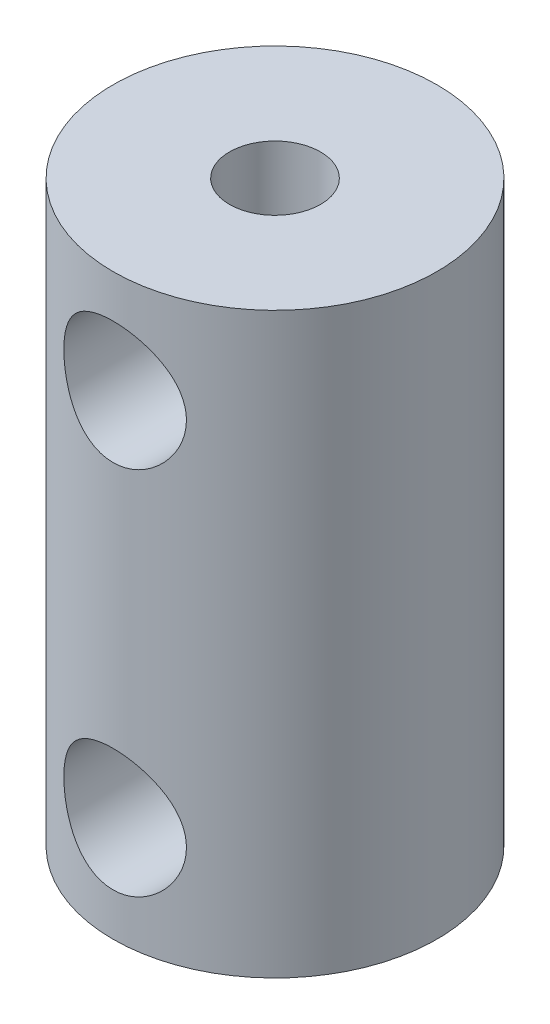
ISO-10303-21;
HEADER;
FILE_DESCRIPTION(('STEP AP214'),'2;1');
FILE_NAME('part.step','',(''),(''),'','','');
FILE_SCHEMA(('AUTOMOTIVE_DESIGN { 1 0 10303 214 1 1 1 1 }'));
ENDSEC;
DATA;
#1=APPLICATION_CONTEXT('core data for automotive mechanical design processes');
#2=APPLICATION_PROTOCOL_DEFINITION('international standard','automotive_design',2000,#1);
#3=PRODUCT_CONTEXT('',#1,'mechanical');
#4=PRODUCT('Part','Part','',(#3));
#5=PRODUCT_RELATED_PRODUCT_CATEGORY('part','',(#4));
#6=PRODUCT_DEFINITION_FORMATION('','',#4);
#7=PRODUCT_DEFINITION_CONTEXT('part definition',#1,'design');
#8=PRODUCT_DEFINITION('design','',#6,#7);
#9=PRODUCT_DEFINITION_SHAPE('','',#8);
#10=(LENGTH_UNIT() NAMED_UNIT(*) SI_UNIT(.MILLI.,.METRE.));
#11=(NAMED_UNIT(*) PLANE_ANGLE_UNIT() SI_UNIT($,.RADIAN.));
#12=(NAMED_UNIT(*) SI_UNIT($,.STERADIAN.) SOLID_ANGLE_UNIT());
#13=UNCERTAINTY_MEASURE_WITH_UNIT(LENGTH_MEASURE(1.E-05),#10,'distance_accuracy_value','');
#14=(GEOMETRIC_REPRESENTATION_CONTEXT(3) GLOBAL_UNCERTAINTY_ASSIGNED_CONTEXT((#13)) GLOBAL_UNIT_ASSIGNED_CONTEXT((#10,
#11,#12)) REPRESENTATION_CONTEXT('',''));
#15=CARTESIAN_POINT('',(0.,0.,0.));
#16=DIRECTION('',(0.,0.,1.));
#17=DIRECTION('',(1.,0.,0.));
#18=AXIS2_PLACEMENT_3D('',#15,#16,#17);
#19=CARTESIAN_POINT('',(0.,19.05,0.));
#20=DIRECTION('',(0.,-1.,0.));
#21=DIRECTION('',(0.,0.,-1.));
#22=AXIS2_PLACEMENT_3D('',#19,#20,#21);
#23=CYLINDRICAL_SURFACE('',#22,5.334);
#24=CARTESIAN_POINT('',(2.0193,15.621,4.93700146951568));
#25=CARTESIAN_POINT('',(2.01930447944565,15.5120335579433,4.93699724405045));
#26=CARTESIAN_POINT('',(2.01045059439057,15.4030962944664,4.94064814854933));
#27=CARTESIAN_POINT('',(1.97543444054489,15.1885111713563,4.95475201963925));
#28=CARTESIAN_POINT('',(1.94927294682313,15.0828631646455,4.96520468163384));
#29=CARTESIAN_POINT('',(1.8807430461981,14.8780172165251,4.99156194094386));
#30=CARTESIAN_POINT('',(1.83841414033232,14.7788042384707,5.00745324054417));
#31=CARTESIAN_POINT('',(1.73889128334472,14.5888489765568,5.04287560500619));
#32=CARTESIAN_POINT('',(1.68169277752621,14.4981092997438,5.06240778458365));
#33=CARTESIAN_POINT('',(1.55095007886271,14.3230779704603,5.1040199433203));
#34=CARTESIAN_POINT('',(1.47677408325426,14.2392761792463,5.12617585427608));
#35=CARTESIAN_POINT('',(1.31552180232293,14.0849552129414,5.16990629793248));
#36=CARTESIAN_POINT('',(1.22844270450761,14.0144389413296,5.19148070266726));
#37=CARTESIAN_POINT('',(1.04012523794396,13.8863181623324,5.23252204526852));
#38=CARTESIAN_POINT('',(0.93849980325783,13.8292478975599,5.25188961400418));
#39=CARTESIAN_POINT('',(0.726227423158127,13.7332177255443,5.28542063488425));
#40=CARTESIAN_POINT('',(0.615583687488663,13.694251407642,5.29958592879611));
#41=CARTESIAN_POINT('',(0.393566749542693,13.637258622755,5.32057718322424));
#42=CARTESIAN_POINT('',(0.282438553669896,13.6183884135688,5.32769789450095));
#43=CARTESIAN_POINT('',(0.0583798398278725,13.5994181530748,5.33485652895422));
#44=CARTESIAN_POINT('',(-0.0545500684529003,13.5993118814679,5.33489679931724));
#45=CARTESIAN_POINT('',(-0.27295176287395,13.6173851886313,5.32807636219454));
#46=CARTESIAN_POINT('',(-0.378512558081567,13.6346433362102,5.32156339727964));
#47=CARTESIAN_POINT('',(-0.585111251091156,13.6854031817999,5.30282614548131));
#48=CARTESIAN_POINT('',(-0.68614882738855,13.7189060324673,5.29060145331974));
#49=CARTESIAN_POINT('',(-0.882591199788242,13.8016228590768,5.26142589156488));
#50=CARTESIAN_POINT('',(-0.977891853376852,13.8510597051342,5.24440843901689));
#51=CARTESIAN_POINT('',(-1.15908281530853,13.964042392838,5.20736477295068));
#52=CARTESIAN_POINT('',(-1.24497004337342,14.027592832296,5.18733757963256));
#53=CARTESIAN_POINT('',(-1.41031734945089,14.1714187169088,5.14492730665769));
#54=CARTESIAN_POINT('',(-1.48909060289719,14.2524645063247,5.12247495361345));
#55=CARTESIAN_POINT('',(-1.6321897223364,14.426744223767,5.07869327063848));
#56=CARTESIAN_POINT('',(-1.69651181554815,14.5199813245657,5.05736423508365));
#57=CARTESIAN_POINT('',(-1.81023010786301,14.7187569660041,5.01780263958016));
#58=CARTESIAN_POINT('',(-1.85924901990288,14.8245291017029,4.99965257367589));
#59=CARTESIAN_POINT('',(-1.93851753880742,15.0436953907817,4.96945937974622));
#60=CARTESIAN_POINT('',(-1.96877783080307,15.1570851641898,4.95741277583277));
#61=CARTESIAN_POINT('',(-2.0080927254921,15.381470834286,4.94161372576153));
#62=CARTESIAN_POINT('',(-2.01824049485178,15.4922448827508,4.93743437273379));
#63=CARTESIAN_POINT('',(-2.02020093934924,15.7139676015321,4.93663342024542));
#64=CARTESIAN_POINT('',(-2.01201832383528,15.8249162196809,4.94000987958409));
#65=CARTESIAN_POINT('',(-1.97854205652087,16.0381681308523,4.95350589275915));
#66=CARTESIAN_POINT('',(-1.95410194104482,16.1406292160252,4.96328872527596));
#67=CARTESIAN_POINT('',(-1.88988298600506,16.3399465155951,4.98809328378994));
#68=CARTESIAN_POINT('',(-1.85010096750629,16.4368015636007,5.00311609548081));
#69=CARTESIAN_POINT('',(-1.75463072385413,16.626246264666,5.03740860205377));
#70=CARTESIAN_POINT('',(-1.69839621410486,16.7185346107973,5.05681781536739));
#71=CARTESIAN_POINT('',(-1.57219523321137,16.8927525289866,5.09746480725639));
#72=CARTESIAN_POINT('',(-1.50222365366067,16.9746782287931,5.11870326441882));
#73=CARTESIAN_POINT('',(-1.34516894631353,17.1313561978071,5.16227937258415));
#74=CARTESIAN_POINT('',(-1.25727058071109,17.2052991261111,5.18459902436317));
#75=CARTESIAN_POINT('',(-1.06976739053702,17.3374862714004,5.22650650196035));
#76=CARTESIAN_POINT('',(-0.970162473418259,17.3957303642651,5.24609430617898));
#77=CARTESIAN_POINT('',(-0.762084546055996,17.4945035084064,5.28032694944767));
#78=CARTESIAN_POINT('',(-0.653639678197282,17.5350863566806,5.29498676788628));
#79=CARTESIAN_POINT('',(-0.430779322695876,17.5971996745722,5.31775366325145));
#80=CARTESIAN_POINT('',(-0.316366729446475,17.6187392909675,5.32586388589443));
#81=CARTESIAN_POINT('',(-0.0921269840688153,17.6411543720754,5.33431446661301));
#82=CARTESIAN_POINT('',(0.0175700260696658,17.6431789284285,5.33508685186249));
#83=CARTESIAN_POINT('',(0.23567589035579,17.629473185899,5.32990684279753));
#84=CARTESIAN_POINT('',(0.344084903230242,17.6137450981927,5.32395528598201));
#85=CARTESIAN_POINT('',(0.553754325491233,17.5657898974954,5.3061959436016));
#86=CARTESIAN_POINT('',(0.65512610504446,17.5339892623025,5.29453976881732));
#87=CARTESIAN_POINT('',(0.851099804673823,17.455219495065,5.26659215506921));
#88=CARTESIAN_POINT('',(0.9457004384355,17.408247490209,5.2502998382871));
#89=CARTESIAN_POINT('',(1.12984126460487,17.2982057895377,5.21384686801513));
#90=CARTESIAN_POINT('',(1.21899691290268,17.234538077362,5.19355150342232));
#91=CARTESIAN_POINT('',(1.38571137675006,17.0938489191121,5.15157869080139));
#92=CARTESIAN_POINT('',(1.46326600313847,17.0168226708103,5.1299007475314));
#93=CARTESIAN_POINT('',(1.60889417238223,16.8466570416454,5.08616858438968));
#94=CARTESIAN_POINT('',(1.6762289849352,16.7528718973078,5.06415732477682));
#95=CARTESIAN_POINT('',(1.79422016325732,16.5546238470352,5.0235682226187));
#96=CARTESIAN_POINT('',(1.84487417660335,16.4501594377681,5.00499086450409));
#97=CARTESIAN_POINT('',(1.92989734602869,16.2276068736325,4.97285117373348));
#98=CARTESIAN_POINT('',(1.96328114135574,16.1090925540968,4.9596003647767));
#99=CARTESIAN_POINT('',(2.00797225124147,15.8673708442459,4.94168088836878));
#100=CARTESIAN_POINT('',(2.01929493679982,15.7441667825565,4.93700624563709));
#101=CARTESIAN_POINT('',(2.0193,15.621,4.93700146951568));
#102=B_SPLINE_CURVE_WITH_KNOTS('',3,(#24,#25,#26,#27,#28,#29,#30,#31,#32,#33,#34,#35,#36,#37,
#38,#39,#40,#41,#42,#43,#44,#45,#46,#47,#48,#49,#50,#51,#52,#53,#54,#55,#56,#57,#58,#59,#60,#61,
#62,#63,#64,#65,#66,#67,#68,#69,#70,#71,#72,#73,#74,#75,#76,#77,#78,#79,#80,#81,#82,#83,#84,#85,
#86,#87,#88,#89,#90,#91,#92,#93,#94,#95,#96,#97,#98,#99,#100,#101),.UNSPECIFIED.,.T.,.F.,(4,2,2,
2,2,2,2,2,2,2,2,2,2,2,2,2,2,2,2,2,2,2,2,2,2,2,2,2,2,2,2,2,2,2,2,2,2,2,4),(0.,0.326440462933106,
0.652866308208242,0.978499662966164,1.30423288001533,1.64497726295525,1.98579602758814,
2.33846601182069,2.6910110192498,3.02808777213958,3.3650527829088,3.68503301877185,
4.00503596242418,4.32972461584072,4.6545191992502,4.99864582720001,5.34286219255831,
5.69499486283585,6.04692676944592,6.37913973630185,6.71126736249903,7.02720512429607,
7.3432083855114,7.67120245546792,7.99931872846169,8.34870603281663,8.69809609946862,
9.04641432838323,9.39456516328482,9.72208120206037,10.0495564516543,10.3687657960399,
10.6880356205533,11.0208403418839,11.3537649513075,11.7046787209908,12.0556419573988,
12.4248810015917,12.7938626876671),.UNSPECIFIED.);
#103=CARTESIAN_POINT('',(2.0193,15.621,4.93700146951568));
#104=VERTEX_POINT('',#103);
#105=EDGE_CURVE('E73',#104,#104,#102,.T.);
#106=ORIENTED_EDGE('',*,*,#105,.T.);
#107=EDGE_LOOP('',(#106));
#108=FACE_BOUND('',#107,.T.);
#109=CARTESIAN_POINT('',(2.0193,3.429,4.93700146951568));
#110=CARTESIAN_POINT('',(2.01930447944565,3.32003355794329,4.93699724405045));
#111=CARTESIAN_POINT('',(2.01045059439057,3.21109629446639,4.94064814854933));
#112=CARTESIAN_POINT('',(1.97543444054489,2.99651117135628,4.95475201963925));
#113=CARTESIAN_POINT('',(1.94927294682313,2.89086316464548,4.96520468163384));
#114=CARTESIAN_POINT('',(1.8807430461981,2.68601721652511,4.99156194094386));
#115=CARTESIAN_POINT('',(1.83841414033232,2.5868042384707,5.00745324054417));
#116=CARTESIAN_POINT('',(1.73889128334472,2.39684897655679,5.04287560500619));
#117=CARTESIAN_POINT('',(1.68169277752621,2.30610929974384,5.06240778458365));
#118=CARTESIAN_POINT('',(1.55095007886271,2.1310779704603,5.1040199433203));
#119=CARTESIAN_POINT('',(1.47677408325426,2.04727617924628,5.12617585427608));
#120=CARTESIAN_POINT('',(1.31552180232293,1.89295521294144,5.16990629793248));
#121=CARTESIAN_POINT('',(1.22844270450761,1.8224389413296,5.19148070266726));
#122=CARTESIAN_POINT('',(1.04012523794396,1.69431816233236,5.23252204526852));
#123=CARTESIAN_POINT('',(0.938499803257831,1.63724789755994,5.25188961400418));
#124=CARTESIAN_POINT('',(0.726227423158129,1.54121772554432,5.28542063488425));
#125=CARTESIAN_POINT('',(0.615583687488665,1.50225140764203,5.29958592879611));
#126=CARTESIAN_POINT('',(0.393566749542696,1.44525862275502,5.32057718322423));
#127=CARTESIAN_POINT('',(0.282438553669898,1.42638841356883,5.32769789450094));
#128=CARTESIAN_POINT('',(0.0583798398278745,1.40741815307482,5.33485652895422));
#129=CARTESIAN_POINT('',(-0.0545500684528985,1.40731188146786,5.33489679931724));
#130=CARTESIAN_POINT('',(-0.272951762873949,1.42538518863126,5.32807636219454));
#131=CARTESIAN_POINT('',(-0.378512558081566,1.44264333621018,5.32156339727964));
#132=CARTESIAN_POINT('',(-0.585111251091155,1.49340318179991,5.30282614548131));
#133=CARTESIAN_POINT('',(-0.686148827388549,1.52690603246726,5.29060145331974));
#134=CARTESIAN_POINT('',(-0.882591199788241,1.60962285907683,5.26142589156488));
#135=CARTESIAN_POINT('',(-0.977891853376851,1.65905970513419,5.24440843901689));
#136=CARTESIAN_POINT('',(-1.15908281530853,1.77204239283796,5.20736477295068));
#137=CARTESIAN_POINT('',(-1.24497004337342,1.83559283229603,5.18733757963256));
#138=CARTESIAN_POINT('',(-1.41031734945089,1.97941871690877,5.14492730665769));
#139=CARTESIAN_POINT('',(-1.48909060289719,2.06046450632471,5.12247495361345));
#140=CARTESIAN_POINT('',(-1.6321897223364,2.23474422376699,5.07869327063848));
#141=CARTESIAN_POINT('',(-1.69651181554814,2.32798132456567,5.05736423508365));
#142=CARTESIAN_POINT('',(-1.81023010786301,2.52675696600407,5.01780263958016));
#143=CARTESIAN_POINT('',(-1.85924901990288,2.63252910170293,4.99965257367589));
#144=CARTESIAN_POINT('',(-1.93851753880742,2.85169539078174,4.96945937974622));
#145=CARTESIAN_POINT('',(-1.96877783080307,2.96508516418983,4.95741277583277));
#146=CARTESIAN_POINT('',(-2.0080927254921,3.18947083428604,4.94161372576153));
#147=CARTESIAN_POINT('',(-2.01824049485178,3.30024488275082,4.93743437273379));
#148=CARTESIAN_POINT('',(-2.02020093934925,3.52196760153214,4.93663342024542));
#149=CARTESIAN_POINT('',(-2.01201832383528,3.63291621968089,4.94000987958409));
#150=CARTESIAN_POINT('',(-1.97854205652087,3.84616813085234,4.95350589275915));
#151=CARTESIAN_POINT('',(-1.95410194104482,3.94862921602521,4.96328872527596));
#152=CARTESIAN_POINT('',(-1.88988298600506,4.14794651559512,4.98809328378994));
#153=CARTESIAN_POINT('',(-1.85010096750629,4.24480156360068,5.00311609548081));
#154=CARTESIAN_POINT('',(-1.75463072385413,4.43424626466602,5.03740860205377));
#155=CARTESIAN_POINT('',(-1.69839621410486,4.5265346107973,5.05681781536739));
#156=CARTESIAN_POINT('',(-1.57219523321137,4.70075252898663,5.09746480725639));
#157=CARTESIAN_POINT('',(-1.50222365366067,4.78267822879312,5.11870326441882));
#158=CARTESIAN_POINT('',(-1.34516894631353,4.93935619780713,5.16227937258415));
#159=CARTESIAN_POINT('',(-1.25727058071109,5.01329912611112,5.18459902436317));
#160=CARTESIAN_POINT('',(-1.06976739053702,5.14548627140036,5.22650650196035));
#161=CARTESIAN_POINT('',(-0.970162473418259,5.20373036426515,5.24609430617898));
#162=CARTESIAN_POINT('',(-0.762084546055996,5.30250350840644,5.28032694944767));
#163=CARTESIAN_POINT('',(-0.653639678197282,5.34308635668056,5.29498676788628));
#164=CARTESIAN_POINT('',(-0.430779322695876,5.40519967457225,5.31775366325145));
#165=CARTESIAN_POINT('',(-0.316366729446476,5.42673929096748,5.32586388589443));
#166=CARTESIAN_POINT('',(-0.0921269840688153,5.44915437207543,5.33431446661301));
#167=CARTESIAN_POINT('',(0.0175700260696657,5.45117892842854,5.33508685186249));
#168=CARTESIAN_POINT('',(0.23567589035579,5.43747318589899,5.32990684279753));
#169=CARTESIAN_POINT('',(0.344084903230242,5.42174509819271,5.32395528598201));
#170=CARTESIAN_POINT('',(0.553754325491233,5.37378989749537,5.3061959436016));
#171=CARTESIAN_POINT('',(0.655126105044461,5.3419892623025,5.29453976881732));
#172=CARTESIAN_POINT('',(0.851099804673823,5.263219495065,5.26659215506921));
#173=CARTESIAN_POINT('',(0.9457004384355,5.21624749020903,5.2502998382871));
#174=CARTESIAN_POINT('',(1.12984126460487,5.1062057895377,5.21384686801513));
#175=CARTESIAN_POINT('',(1.21899691290268,5.04253807736199,5.19355150342232));
#176=CARTESIAN_POINT('',(1.38571137675006,4.90184891911211,5.15157869080139));
#177=CARTESIAN_POINT('',(1.46326600313847,4.82482267081035,5.1299007475314));
#178=CARTESIAN_POINT('',(1.60889417238223,4.65465704164544,5.08616858438968));
#179=CARTESIAN_POINT('',(1.6762289849352,4.5608718973078,5.06415732477682));
#180=CARTESIAN_POINT('',(1.79422016325732,4.36262384703517,5.0235682226187));
#181=CARTESIAN_POINT('',(1.84487417660335,4.25815943776813,5.00499086450409));
#182=CARTESIAN_POINT('',(1.92989734602869,4.03560687363247,4.97285117373348));
#183=CARTESIAN_POINT('',(1.96328114135574,3.91709255409683,4.9596003647767));
#184=CARTESIAN_POINT('',(2.00797225124147,3.67537084424586,4.94168088836878));
#185=CARTESIAN_POINT('',(2.01929493679982,3.55216678255649,4.93700624563709));
#186=CARTESIAN_POINT('',(2.0193,3.429,4.93700146951568));
#187=B_SPLINE_CURVE_WITH_KNOTS('',3,(#109,#110,#111,#112,#113,#114,#115,#116,#117,#118,#119,
#120,#121,#122,#123,#124,#125,#126,#127,#128,#129,#130,#131,#132,#133,#134,#135,#136,#137,#138,
#139,#140,#141,#142,#143,#144,#145,#146,#147,#148,#149,#150,#151,#152,#153,#154,#155,#156,#157,
#158,#159,#160,#161,#162,#163,#164,#165,#166,#167,#168,#169,#170,#171,#172,#173,#174,#175,#176,
#177,#178,#179,#180,#181,#182,#183,#184,#185,#186),.UNSPECIFIED.,.T.,.F.,(4,2,2,2,2,2,2,2,2,2,2,
2,2,2,2,2,2,2,2,2,2,2,2,2,2,2,2,2,2,2,2,2,2,2,2,2,2,2,4),(0.,0.326440462933105,
0.652866308208241,0.978499662966162,1.30423288001533,1.64497726295524,1.98579602758814,
2.33846601182069,2.6910110192498,3.02808777213957,3.3650527829088,3.68503301877185,
4.00503596242418,4.32972461584072,4.6545191992502,4.99864582720001,5.3428621925583,
5.69499486283585,6.04692676944592,6.37913973630185,6.71126736249903,7.02720512429606,
7.3432083855114,7.67120245546792,7.99931872846169,8.34870603281663,8.69809609946862,
9.04641432838323,9.39456516328482,9.72208120206037,10.0495564516543,10.3687657960399,
10.6880356205533,11.0208403418839,11.3537649513075,11.7046787209908,12.0556419573988,
12.4248810015917,12.7938626876671),.UNSPECIFIED.);
#188=CARTESIAN_POINT('',(2.0193,3.429,4.93700146951568));
#189=VERTEX_POINT('',#188);
#190=EDGE_CURVE('E107',#189,#189,#187,.T.);
#191=ORIENTED_EDGE('',*,*,#190,.T.);
#192=EDGE_LOOP('',(#191));
#193=FACE_BOUND('',#192,.T.);
#194=CARTESIAN_POINT('',(0.,19.05,0.));
#195=DIRECTION('',(0.,1.,0.));
#196=DIRECTION('',(0.,0.,1.));
#197=AXIS2_PLACEMENT_3D('',#194,#195,#196);
#198=CIRCLE('',#197,5.334);
#199=CARTESIAN_POINT('',(0.,19.05,5.334));
#200=VERTEX_POINT('',#199);
#201=EDGE_CURVE('E80',#200,#200,#198,.T.);
#202=ORIENTED_EDGE('',*,*,#201,.F.);
#203=EDGE_LOOP('',(#202));
#204=FACE_BOUND('',#203,.T.);
#205=CARTESIAN_POINT('',(0.,0.,0.));
#206=DIRECTION('',(0.,1.,0.));
#207=DIRECTION('',(0.,0.,1.));
#208=AXIS2_PLACEMENT_3D('',#205,#206,#207);
#209=CIRCLE('',#208,5.334);
#210=CARTESIAN_POINT('',(0.,0.,5.334));
#211=VERTEX_POINT('',#210);
#212=EDGE_CURVE('E155',#211,#211,#209,.T.);
#213=ORIENTED_EDGE('',*,*,#212,.T.);
#214=EDGE_LOOP('',(#213));
#215=FACE_BOUND('',#214,.T.);
#216=ADVANCED_FACE('F35',(#108,#193,#204,#215),#23,.T.);
#217=CARTESIAN_POINT('',(0.,19.05,0.));
#218=DIRECTION('',(0.,1.,0.));
#219=DIRECTION('',(0.,0.,1.));
#220=AXIS2_PLACEMENT_3D('',#217,#218,#219);
#221=PLANE('',#220);
#222=CARTESIAN_POINT('',(0.,19.05,0.));
#223=DIRECTION('',(0.,1.,0.));
#224=DIRECTION('',(0.,0.,1.));
#225=AXIS2_PLACEMENT_3D('',#222,#223,#224);
#226=CIRCLE('',#225,1.5);
#227=CARTESIAN_POINT('',(0.,19.05,1.5));
#228=VERTEX_POINT('',#227);
#229=EDGE_CURVE('E152',#228,#228,#226,.T.);
#230=ORIENTED_EDGE('',*,*,#229,.F.);
#231=EDGE_LOOP('',(#230));
#232=FACE_BOUND('',#231,.T.);
#233=ORIENTED_EDGE('',*,*,#201,.T.);
#234=EDGE_LOOP('',(#233));
#235=FACE_BOUND('',#234,.T.);
#236=ADVANCED_FACE('F95',(#232,#235),#221,.T.);
#237=CARTESIAN_POINT('',(0.,0.,0.));
#238=DIRECTION('',(0.,1.,0.));
#239=DIRECTION('',(0.,0.,1.));
#240=AXIS2_PLACEMENT_3D('',#237,#238,#239);
#241=PLANE('',#240);
#242=CARTESIAN_POINT('',(0.,0.,0.));
#243=DIRECTION('',(0.,-1.,0.));
#244=DIRECTION('',(0.,0.,-1.));
#245=AXIS2_PLACEMENT_3D('',#242,#243,#244);
#246=CIRCLE('',#245,2.38125);
#247=CARTESIAN_POINT('',(0.,0.,-2.38125));
#248=VERTEX_POINT('',#247);
#249=EDGE_CURVE('E148',#248,#248,#246,.T.);
#250=ORIENTED_EDGE('',*,*,#249,.F.);
#251=EDGE_LOOP('',(#250));
#252=FACE_BOUND('',#251,.T.);
#253=ORIENTED_EDGE('',*,*,#212,.F.);
#254=EDGE_LOOP('',(#253));
#255=FACE_BOUND('',#254,.T.);
#256=ADVANCED_FACE('F93',(#252,#255),#241,.F.);
#257=CARTESIAN_POINT('',(0.,19.05,0.));
#258=DIRECTION('',(0.,1.,0.));
#259=DIRECTION('',(0.,0.,1.));
#260=AXIS2_PLACEMENT_3D('',#257,#258,#259);
#261=CYLINDRICAL_SURFACE('',#260,1.5);
#262=DIRECTION('',(0.,1.,0.));
#263=VECTOR('',#262,1.);
#264=CARTESIAN_POINT('',(1.5,19.05,0.));
#265=LINE('',#264,#263);
#266=CARTESIAN_POINT('',(1.5,14.2691226054113,0.));
#267=VERTEX_POINT('',#266);
#268=CARTESIAN_POINT('',(1.5,16.9728773945887,0.));
#269=VERTEX_POINT('',#268);
#270=EDGE_CURVE('E69',#267,#269,#265,.T.);
#271=ORIENTED_EDGE('',*,*,#270,.T.);
#272=CARTESIAN_POINT('',(1.5,16.9728773945887,0.));
#273=CARTESIAN_POINT('',(1.50001129468853,16.9728498704976,0.035493116242662));
#274=CARTESIAN_POINT('',(1.49874079697882,16.9742744968344,0.0709674571076724));
#275=CARTESIAN_POINT('',(1.49372878648423,16.9798124688908,0.141460963719676));
#276=CARTESIAN_POINT('',(1.4899922147688,16.9839204380487,0.176480897154805));
#277=CARTESIAN_POINT('',(1.48020170904993,16.9945440900119,0.245358139486193));
#278=CARTESIAN_POINT('',(1.47417740902387,17.0010289479818,0.279224519180875));
#279=CARTESIAN_POINT('',(1.45994298002481,17.0160796104585,0.346025465617944));
#280=CARTESIAN_POINT('',(1.45173184952528,17.0246463682779,0.378959597743889));
#281=CARTESIAN_POINT('',(1.42417288021039,17.0527772305544,0.475596921601967));
#282=CARTESIAN_POINT('',(1.40181160119991,17.0748742077302,0.537724795397961));
#283=CARTESIAN_POINT('',(1.34988517284691,17.1232135521048,0.657333782400029));
#284=CARTESIAN_POINT('',(1.32029391099814,17.1494708213914,0.714797022970196));
#285=CARTESIAN_POINT('',(1.24784249682955,17.2094248598259,0.835958547941966));
#286=CARTESIAN_POINT('',(1.2035090312466,17.2435519361456,0.898565855304275));
#287=CARTESIAN_POINT('',(1.10580338980637,17.3116589101549,1.01639527835982));
#288=CARTESIAN_POINT('',(1.05242614589239,17.3456387143038,1.0716132218902));
#289=CARTESIAN_POINT('',(0.925412960465617,17.4175281438154,1.18413227281573));
#290=CARTESIAN_POINT('',(0.849859162881838,17.4548758142778,1.23966465521298));
#291=CARTESIAN_POINT('',(0.687172880120412,17.5218025731585,1.33667630044926));
#292=CARTESIAN_POINT('',(0.600065633240208,17.5513981881109,1.37818551484536));
#293=CARTESIAN_POINT('',(0.443997443860888,17.5920117022752,1.43442190406477));
#294=CARTESIAN_POINT('',(0.37732692294943,17.6059364710982,1.4534416192838));
#295=CARTESIAN_POINT('',(0.240982811996157,17.6270512585627,1.48214913795093));
#296=CARTESIAN_POINT('',(0.171311917154701,17.6342471948717,1.49184514134463));
#297=CARTESIAN_POINT('',(0.0307453820241244,17.641295025059,1.50134260415701));
#298=CARTESIAN_POINT('',(-0.040152887045167,17.641128493982,1.50111923983877));
#299=CARTESIAN_POINT('',(-0.180814427277298,17.6334219901726,1.49073193409239));
#300=CARTESIAN_POINT('',(-0.25057742144969,17.6258802446249,1.48056560262582));
#301=CARTESIAN_POINT('',(-0.384733591425827,17.6044370035182,1.45139358756786));
#302=CARTESIAN_POINT('',(-0.449227649022612,17.5907505767983,1.43268649111291));
#303=CARTESIAN_POINT('',(-0.573955123627268,17.5580879118076,1.38743709056438));
#304=CARTESIAN_POINT('',(-0.634187587818755,17.5391104952222,1.36089304108713));
#305=CARTESIAN_POINT('',(-0.755841520544671,17.4947431369184,1.29765353303463));
#306=CARTESIAN_POINT('',(-0.816675569577295,17.4688794344765,1.26016643001126));
#307=CARTESIAN_POINT('',(-0.931466877816408,17.4137644586993,1.17786515217726));
#308=CARTESIAN_POINT('',(-0.9854184626932,17.3845104276044,1.13304500014657));
#309=CARTESIAN_POINT('',(-1.09591020603779,17.318484923816,1.0275697430127));
#310=CARTESIAN_POINT('',(-1.15091678418129,17.2813571688992,0.965529955933535));
#311=CARTESIAN_POINT('',(-1.25027260431546,17.2078846558467,0.832883103194655));
#312=CARTESIAN_POINT('',(-1.29461262759138,17.1715405995501,0.762268705548728));
#313=CARTESIAN_POINT('',(-1.3638525161855,17.1106829164333,0.628003817651128));
#314=CARTESIAN_POINT('',(-1.39087222384285,17.0852668658052,0.565860322188022));
#315=CARTESIAN_POINT('',(-1.436621316259,17.0404061837489,0.436776453655058));
#316=CARTESIAN_POINT('',(-1.45538996903248,17.0209334059186,0.369860602538525));
#317=CARTESIAN_POINT('',(-1.4794394200465,16.9954296611879,0.252404550514955));
#318=CARTESIAN_POINT('',(-1.48706444021181,16.9871290744039,0.202844012167513));
#319=CARTESIAN_POINT('',(-1.49738321505979,16.9757828218253,0.102234402078089));
#320=CARTESIAN_POINT('',(-1.50003741934815,16.9727793132432,0.0511766476112552));
#321=CARTESIAN_POINT('',(-1.5,16.9728773945887,0.));
#322=B_SPLINE_CURVE_WITH_KNOTS('',3,(#272,#273,#274,#275,#276,#277,#278,#279,#280,#281,#282,
#283,#284,#285,#286,#287,#288,#289,#290,#291,#292,#293,#294,#295,#296,#297,#298,#299,#300,#301,
#302,#303,#304,#305,#306,#307,#308,#309,#310,#311,#312,#313,#314,#315,#316,#317,#318,#319,#320,
#321),.UNSPECIFIED.,.F.,.F.,(4,2,2,2,2,2,2,2,2,2,2,2,2,2,2,2,2,2,2,2,2,2,2,2,4),(0.,
0.106397934757032,0.212583333299286,0.31743775390467,0.422340278655351,0.630354000845101,
0.839130408991494,1.09014997247343,1.34131067329047,1.64240926623714,1.94286062692909,
2.15411165168965,2.36517671665849,2.57677001269483,2.78841418292431,2.99316721989893,
3.19796589227988,3.42511159968748,3.65244338610993,3.92394244182618,4.19567530799363,
4.41211242200311,4.62750802359911,4.77948212266865,4.93266035239562),.UNSPECIFIED.);
#323=CARTESIAN_POINT('',(-1.5,16.9728773945887,0.));
#324=VERTEX_POINT('',#323);
#325=EDGE_CURVE('E11',#269,#324,#322,.T.);
#326=ORIENTED_EDGE('',*,*,#325,.T.);
#327=DIRECTION('',(0.,1.,0.));
#328=VECTOR('',#327,1.);
#329=CARTESIAN_POINT('',(-1.5,19.05,0.));
#330=LINE('',#329,#328);
#331=CARTESIAN_POINT('',(-1.5,14.2691226054113,0.));
#332=VERTEX_POINT('',#331);
#333=EDGE_CURVE('E47',#324,#332,#330,.F.);
#334=ORIENTED_EDGE('',*,*,#333,.T.);
#335=CARTESIAN_POINT('',(-1.5,14.2691226054113,0.));
#336=CARTESIAN_POINT('',(-1.50001129468853,14.2691501295024,0.035493116242662));
#337=CARTESIAN_POINT('',(-1.49874079697882,14.2677255031656,0.0709674571076722));
#338=CARTESIAN_POINT('',(-1.49372878648423,14.2621875311092,0.141460963719676));
#339=CARTESIAN_POINT('',(-1.4899922147688,14.2580795619513,0.176480897154804));
#340=CARTESIAN_POINT('',(-1.48020170904993,14.2474559099881,0.245358139486193));
#341=CARTESIAN_POINT('',(-1.47417740902387,14.2409710520182,0.279224519180875));
#342=CARTESIAN_POINT('',(-1.45994298002482,14.2259203895415,0.346025465617945));
#343=CARTESIAN_POINT('',(-1.45173184952528,14.2173536317221,0.378959597743889));
#344=CARTESIAN_POINT('',(-1.42417288021039,14.1892227694456,0.475596921601967));
#345=CARTESIAN_POINT('',(-1.40181160119991,14.1671257922698,0.537724795397961));
#346=CARTESIAN_POINT('',(-1.34988517284691,14.1187864478952,0.657333782400029));
#347=CARTESIAN_POINT('',(-1.32029391099814,14.0925291786086,0.714797022970196));
#348=CARTESIAN_POINT('',(-1.24784249682955,14.0325751401741,0.835958547941966));
#349=CARTESIAN_POINT('',(-1.2035090312466,13.9984480638544,0.898565855304275));
#350=CARTESIAN_POINT('',(-1.10580338980637,13.9303410898451,1.01639527835982));
#351=CARTESIAN_POINT('',(-1.05242614589239,13.8963612856962,1.0716132218902));
#352=CARTESIAN_POINT('',(-0.925412960465617,13.8244718561846,1.18413227281573));
#353=CARTESIAN_POINT('',(-0.849859162881837,13.7871241857222,1.23966465521298));
#354=CARTESIAN_POINT('',(-0.687172880120413,13.7201974268415,1.33667630044926));
#355=CARTESIAN_POINT('',(-0.600065633240209,13.6906018118891,1.37818551484536));
#356=CARTESIAN_POINT('',(-0.44399744386089,13.6499882977248,1.43442190406477));
#357=CARTESIAN_POINT('',(-0.377326922949432,13.6360635289018,1.4534416192838));
#358=CARTESIAN_POINT('',(-0.240982811996159,13.6149487414373,1.48214913795093));
#359=CARTESIAN_POINT('',(-0.171311917154703,13.6077528051283,1.49184514134463));
#360=CARTESIAN_POINT('',(-0.0307453820241264,13.600704974941,1.50134260415701));
#361=CARTESIAN_POINT('',(0.0401528870451647,13.600871506018,1.50111923983877));
#362=CARTESIAN_POINT('',(0.180814427277295,13.6085780098274,1.49073193409239));
#363=CARTESIAN_POINT('',(0.250577421449687,13.6161197553751,1.48056560262582));
#364=CARTESIAN_POINT('',(0.384733591425824,13.6375629964818,1.45139358756787));
#365=CARTESIAN_POINT('',(0.449227649022608,13.6512494232017,1.43268649111291));
#366=CARTESIAN_POINT('',(0.573955123627264,13.6839120881924,1.38743709056439));
#367=CARTESIAN_POINT('',(0.634187587818751,13.7028895047778,1.36089304108713));
#368=CARTESIAN_POINT('',(0.755841520544668,13.7472568630816,1.29765353303463));
#369=CARTESIAN_POINT('',(0.816675569577292,13.7731205655236,1.26016643001126));
#370=CARTESIAN_POINT('',(0.931466877816405,13.8282355413007,1.17786515217727));
#371=CARTESIAN_POINT('',(0.985418462693197,13.8574895723956,1.13304500014658));
#372=CARTESIAN_POINT('',(1.09591020603778,13.923515076184,1.0275697430127));
#373=CARTESIAN_POINT('',(1.15091678418128,13.9606428311008,0.965529955933538));
#374=CARTESIAN_POINT('',(1.25027260431546,14.0341153441533,0.832883103194659));
#375=CARTESIAN_POINT('',(1.29461262759138,14.0704594004499,0.762268705548731));
#376=CARTESIAN_POINT('',(1.36385251618549,14.1313170835667,0.628003817651132));
#377=CARTESIAN_POINT('',(1.39087222384285,14.1567331341948,0.565860322188025));
#378=CARTESIAN_POINT('',(1.436621316259,14.2015938162511,0.436776453655062));
#379=CARTESIAN_POINT('',(1.45538996903248,14.2210665940814,0.369860602538528));
#380=CARTESIAN_POINT('',(1.4794394200465,14.2465703388121,0.252404550514958));
#381=CARTESIAN_POINT('',(1.48706444021181,14.2548709255961,0.202844012167516));
#382=CARTESIAN_POINT('',(1.49738321505979,14.2662171781747,0.10223440207809));
#383=CARTESIAN_POINT('',(1.50003741934815,14.2692206867568,0.0511766476112561));
#384=CARTESIAN_POINT('',(1.5,14.2691226054113,0.));
#385=B_SPLINE_CURVE_WITH_KNOTS('',3,(#335,#336,#337,#338,#339,#340,#341,#342,#343,#344,#345,
#346,#347,#348,#349,#350,#351,#352,#353,#354,#355,#356,#357,#358,#359,#360,#361,#362,#363,#364,
#365,#366,#367,#368,#369,#370,#371,#372,#373,#374,#375,#376,#377,#378,#379,#380,#381,#382,#383,
#384),.UNSPECIFIED.,.F.,.F.,(4,2,2,2,2,2,2,2,2,2,2,2,2,2,2,2,2,2,2,2,2,2,2,2,4),(0.,
0.106397934757032,0.212583333299286,0.317437753904671,0.422340278655352,0.6303540008451,
0.839130408991495,1.09014997247343,1.34131067329047,1.64240926623714,1.94286062692909,
2.15411165168964,2.36517671665848,2.57677001269482,2.78841418292431,2.99316721989893,
3.19796589227987,3.42511159968748,3.65244338610992,3.92394244182618,4.19567530799363,
4.41211242200311,4.62750802359911,4.77948212266865,4.93266035239562),.UNSPECIFIED.);
#386=EDGE_CURVE('E72',#332,#267,#385,.T.);
#387=ORIENTED_EDGE('',*,*,#386,.T.);
#388=EDGE_LOOP('',(#271,#326,#334,#387));
#389=FACE_BOUND('',#388,.T.);
#390=CARTESIAN_POINT('',(0.,10.054508420518,0.));
#391=DIRECTION('',(0.,-1.,0.));
#392=DIRECTION('',(0.,0.,-1.));
#393=AXIS2_PLACEMENT_3D('',#390,#391,#392);
#394=CIRCLE('',#393,1.5);
#395=CARTESIAN_POINT('',(0.,10.054508420518,-1.5));
#396=VERTEX_POINT('',#395);
#397=EDGE_CURVE('E86',#396,#396,#394,.T.);
#398=ORIENTED_EDGE('',*,*,#397,.T.);
#399=EDGE_LOOP('',(#398));
#400=FACE_BOUND('',#399,.T.);
#401=ORIENTED_EDGE('',*,*,#229,.T.);
#402=EDGE_LOOP('',(#401));
#403=FACE_BOUND('',#402,.T.);
#404=ADVANCED_FACE('F76',(#389,#400,#403),#261,.F.);
#405=CARTESIAN_POINT('',(0.,9.525,0.));
#406=DIRECTION('',(0.,-1.,0.));
#407=DIRECTION('',(0.,0.,-1.));
#408=AXIS2_PLACEMENT_3D('',#405,#406,#407);
#409=CONICAL_SURFACE('',#408,2.38125,1.02974425867665);
#410=CARTESIAN_POINT('',(0.,9.525,0.));
#411=DIRECTION('',(0.,-1.,0.));
#412=DIRECTION('',(0.,0.,-1.));
#413=AXIS2_PLACEMENT_3D('',#410,#411,#412);
#414=CIRCLE('',#413,2.38125);
#415=CARTESIAN_POINT('',(0.,9.525,-2.38125));
#416=VERTEX_POINT('',#415);
#417=EDGE_CURVE('E145',#416,#416,#414,.T.);
#418=ORIENTED_EDGE('',*,*,#417,.T.);
#419=EDGE_LOOP('',(#418));
#420=FACE_BOUND('',#419,.T.);
#421=ORIENTED_EDGE('',*,*,#397,.F.);
#422=EDGE_LOOP('',(#421));
#423=FACE_BOUND('',#422,.T.);
#424=ADVANCED_FACE('F92',(#420,#423),#409,.F.);
#425=CARTESIAN_POINT('',(0.,0.,0.));
#426=DIRECTION('',(0.,-1.,0.));
#427=DIRECTION('',(0.,0.,-1.));
#428=AXIS2_PLACEMENT_3D('',#425,#426,#427);
#429=CYLINDRICAL_SURFACE('',#428,2.38125);
#430=CARTESIAN_POINT('',(2.0193,3.429,1.26205351411895));
#431=CARTESIAN_POINT('',(2.01929069614342,3.49817682715141,1.26207834818194));
#432=CARTESIAN_POINT('',(2.01569819232828,3.56746296972695,1.26787264236479));
#433=CARTESIAN_POINT('',(2.00170746158241,3.70374655074318,1.28983295358871));
#434=CARTESIAN_POINT('',(1.99128374013324,3.7707344224388,1.30603781902955));
#435=CARTESIAN_POINT('',(1.95902417177263,3.92755918604545,1.35414211371878));
#436=CARTESIAN_POINT('',(1.93427214745227,4.0156194124292,1.38974330080966));
#437=CARTESIAN_POINT('',(1.87479805373406,4.18449624754555,1.46899601890634));
#438=CARTESIAN_POINT('',(1.84004287962899,4.26528761561711,1.51267410535375));
#439=CARTESIAN_POINT('',(1.77145888388123,4.40043068181737,1.59194922541477));
#440=CARTESIAN_POINT('',(1.73964428601512,4.45627938032297,1.62677479246894));
#441=CARTESIAN_POINT('',(1.67108624536989,4.56440580448871,1.69712705673677));
#442=CARTESIAN_POINT('',(1.63434050788885,4.61668185042086,1.73265407376537));
#443=CARTESIAN_POINT('',(1.51683389661549,4.76806753592438,1.83865370625967));
#444=CARTESIAN_POINT('',(1.42868222573539,4.86197277398483,1.90869377825568));
#445=CARTESIAN_POINT('',(1.25424544236118,5.01480327662495,2.02627117284775));
#446=CARTESIAN_POINT('',(1.17176560680295,5.07688766324537,2.07538046635528));
#447=CARTESIAN_POINT('',(0.995144437654028,5.1891603033646,2.16559905085797));
#448=CARTESIAN_POINT('',(0.901022769631744,5.23936821191,2.20672153918803));
#449=CARTESIAN_POINT('',(0.720102687516152,5.31763329694214,2.27141503561886));
#450=CARTESIAN_POINT('',(0.634978804343454,5.34804184823606,2.29680682720742));
#451=CARTESIAN_POINT('',(0.459295242351268,5.39748362334699,2.33827360190393));
#452=CARTESIAN_POINT('',(0.368738771717808,5.41652348950906,2.3543540251687));
#453=CARTESIAN_POINT('',(0.184178102375981,5.4420480962751,2.37594081753027));
#454=CARTESIAN_POINT('',(0.0901601947754699,5.44847581841348,2.38139916418407));
#455=CARTESIAN_POINT('',(-0.0978312875715165,5.44811689623852,2.38109465784764));
#456=CARTESIAN_POINT('',(-0.191804865095053,5.44133123465512,2.37533263935893));
#457=CARTESIAN_POINT('',(-0.369829119869925,5.41603141942261,2.35393975756272));
#458=CARTESIAN_POINT('',(-0.454102773789329,5.39841164137381,2.33906173918672));
#459=CARTESIAN_POINT('',(-0.618011161917588,5.35328347650755,2.30119449954447));
#460=CARTESIAN_POINT('',(-0.697645173068385,5.32577355314021,2.27820401792235));
#461=CARTESIAN_POINT('',(-0.857102254884213,5.25957069129196,2.22337447550645));
#462=CARTESIAN_POINT('',(-0.936430596063287,5.22015906892873,2.19097458650898));
#463=CARTESIAN_POINT('',(-1.08729595535357,5.13281172169655,2.12016646071778));
#464=CARTESIAN_POINT('',(-1.15882669706475,5.08486921070694,2.08175344356997));
#465=CARTESIAN_POINT('',(-1.32713130668972,4.95622182700645,1.9806233453438));
#466=CARTESIAN_POINT('',(-1.41894083773711,4.87102509658756,1.91526771996366));
#467=CARTESIAN_POINT('',(-1.54295896209586,4.73310473876734,1.81452288155035));
#468=CARTESIAN_POINT('',(-1.58206554257606,4.68536189963757,1.78043445384078));
#469=CARTESIAN_POINT('',(-1.6557231741033,4.58655901687076,1.71214775433689));
#470=CARTESIAN_POINT('',(-1.69027571094326,4.53550006329857,1.67794952211585));
#471=CARTESIAN_POINT('',(-1.77193831470335,4.4020341822102,1.59238445133492));
#472=CARTESIAN_POINT('',(-1.81597232481737,4.3173796661416,1.54154494969956));
#473=CARTESIAN_POINT('',(-1.8925745651993,4.1396732027058,1.44644541197771));
#474=CARTESIAN_POINT('',(-1.92517674068007,4.04664716514821,1.40216612631798));
#475=CARTESIAN_POINT('',(-1.96756235610552,3.88758943679196,1.34159874373533));
#476=CARTESIAN_POINT('',(-1.98132569898161,3.82429839842631,1.32101497699018));
#477=CARTESIAN_POINT('',(-2.00282258805373,3.69464976232847,1.28819345712641));
#478=CARTESIAN_POINT('',(-2.01057128715618,3.62830031993938,1.27593474023492));
#479=CARTESIAN_POINT('',(-2.01941232786742,3.49337015454512,1.26190657895244));
#480=CARTESIAN_POINT('',(-2.02044327261414,3.42477459387103,1.26023388944409));
#481=CARTESIAN_POINT('',(-2.01556083869343,3.28844694467207,1.26802184253678));
#482=CARTESIAN_POINT('',(-2.00963979632395,3.22071589242861,1.27749477182188));
#483=CARTESIAN_POINT('',(-1.98956343206608,3.07437856706858,1.30858077046125));
#484=CARTESIAN_POINT('',(-1.97394975667622,2.99644594263751,1.33231169710251));
#485=CARTESIAN_POINT('',(-1.93482982557505,2.84581177097429,1.38850589212488));
#486=CARTESIAN_POINT('',(-1.91129622843133,2.77312941941503,1.42099933247892));
#487=CARTESIAN_POINT('',(-1.8622109851866,2.64573099327476,1.48453172679949));
#488=CARTESIAN_POINT('',(-1.83780421667453,2.59015103679664,1.51476097986175));
#489=CARTESIAN_POINT('',(-1.78460130555127,2.48222072778085,1.57709679470817));
#490=CARTESIAN_POINT('',(-1.75580256594951,2.4298723119642,1.6092044602357));
#491=CARTESIAN_POINT('',(-1.66296569761895,2.27733963410098,1.70672871712815));
#492=CARTESIAN_POINT('',(-1.59250686422024,2.18171864871216,1.77331900441523));
#493=CARTESIAN_POINT('',(-1.43157192681938,1.99948118109914,1.90586229584928));
#494=CARTESIAN_POINT('',(-1.34041237812612,1.9133726646081,1.97168512621193));
#495=CARTESIAN_POINT('',(-1.13986712934814,1.75738650242886,2.09397845141378));
#496=CARTESIAN_POINT('',(-1.03053899360256,1.68745921216387,2.15047739504029));
#497=CARTESIAN_POINT('',(-0.832544279266737,1.58711179667992,2.23266636505351));
#498=CARTESIAN_POINT('',(-0.748348963883747,1.55119829628445,2.2624416984859));
#499=CARTESIAN_POINT('',(-0.573414412908043,1.49062147094881,2.31296515379967));
#500=CARTESIAN_POINT('',(-0.482680158694469,1.46594968480591,2.33372006445876));
#501=CARTESIAN_POINT('',(-0.296298840548721,1.42928841083384,2.3646411600109));
#502=CARTESIAN_POINT('',(-0.200625508654203,1.41737610033101,2.37474290224062));
#503=CARTESIAN_POINT('',(-0.00804355812672124,1.40741832747596,2.38318348205976));
#504=CARTESIAN_POINT('',(0.0888646725839776,1.40936861263584,2.38152592692989));
#505=CARTESIAN_POINT('',(0.271546322772845,1.42613583817545,2.367325101978));
#506=CARTESIAN_POINT('',(0.357517624305168,1.4397402801,2.35580772032653));
#507=CARTESIAN_POINT('',(0.525467600754692,1.47736806261729,2.32412212366555));
#508=CARTESIAN_POINT('',(0.607445366354403,1.50139376388303,2.30395194859571));
#509=CARTESIAN_POINT('',(0.769620579010731,1.56002930887069,2.25511725417201));
#510=CARTESIAN_POINT('',(0.849542221542354,1.59509309706415,2.2260904794914));
#511=CARTESIAN_POINT('',(1.00217987566064,1.67383804861853,2.16168019938314));
#512=CARTESIAN_POINT('',(1.07489423966892,1.71752117555944,2.12629524565693));
#513=CARTESIAN_POINT('',(1.24590509670616,1.83505766546833,2.03263782311289));
#514=CARTESIAN_POINT('',(1.3396466905496,1.91330653664919,1.97155237825093));
#515=CARTESIAN_POINT('',(1.51040260668564,2.08331099604658,1.84402429390584));
#516=CARTESIAN_POINT('',(1.58734217032918,2.1751240195134,1.77755944568272));
#517=CARTESIAN_POINT('',(1.69055147425489,2.32297020111634,1.67772189071277));
#518=CARTESIAN_POINT('',(1.72318010995839,2.37449967180662,1.64408722804093));
#519=CARTESIAN_POINT('',(1.78394579768792,2.48091254357624,1.57794227502372));
#520=CARTESIAN_POINT('',(1.81208012645911,2.53579795049371,1.54543267566727));
#521=CARTESIAN_POINT('',(1.86351963967838,2.64880538426474,1.48299474733341));
#522=CARTESIAN_POINT('',(1.88684750730146,2.70691048563496,1.45305470189512));
#523=CARTESIAN_POINT('',(1.92844609103358,2.82676903037061,1.39737351611469));
#524=CARTESIAN_POINT('',(1.94672484665582,2.88851648164473,1.37162572775577));
#525=CARTESIAN_POINT('',(1.97744231083167,3.01491405572007,1.32695139009156));
#526=CARTESIAN_POINT('',(1.9899566944634,3.07951359723965,1.30793725668627));
#527=CARTESIAN_POINT('',(2.00864434223467,3.21149425880625,1.27906792762836));
#528=CARTESIAN_POINT('',(2.01484473259539,3.27886217499561,1.26917356908597));
#529=CARTESIAN_POINT('',(2.01874166931565,3.37404323227601,1.26294467521575));
#530=CARTESIAN_POINT('',(2.01930369683376,3.40151298664507,1.26204364644723));
#531=CARTESIAN_POINT('',(2.0193,3.429,1.26205351411895));
#532=B_SPLINE_CURVE_WITH_KNOTS('',3,(#430,#431,#432,#433,#434,#435,#436,#437,#438,#439,#440,
#441,#442,#443,#444,#445,#446,#447,#448,#449,#450,#451,#452,#453,#454,#455,#456,#457,#458,#459,
#460,#461,#462,#463,#464,#465,#466,#467,#468,#469,#470,#471,#472,#473,#474,#475,#476,#477,#478,
#479,#480,#481,#482,#483,#484,#485,#486,#487,#488,#489,#490,#491,#492,#493,#494,#495,#496,#497,
#498,#499,#500,#501,#502,#503,#504,#505,#506,#507,#508,#509,#510,#511,#512,#513,#514,#515,#516,
#517,#518,#519,#520,#521,#522,#523,#524,#525,#526,#527,#528,#529,#530,#531),.UNSPECIFIED.,.T.,
.F.,(4,2,2,2,2,2,2,2,2,2,2,2,2,2,2,2,2,2,2,2,2,2,2,2,2,2,2,2,2,2,2,2,2,2,2,2,2,2,2,2,2,2,2,2,2,
2,2,2,2,2,4),(0.,0.207427932099814,0.415634440373042,0.708447679359938,1.00224133007215,
1.22128414234343,1.44042924178498,1.87781220983385,2.21957259490705,2.56076336136633,
2.84127537611175,3.121623336225,3.40323583253448,3.68482738504409,3.94581770746448,
4.2068485953222,4.48876604165899,4.77090875746733,5.1922955085102,5.40364465124519,
5.61492466804793,5.93840870532678,6.26092390247375,6.4641601639644,6.66688272810435,
6.87145550542314,7.07625401071243,7.32371419414543,7.57203758452362,7.77521151543997,
7.97850605310875,8.3852762723553,8.80818986905018,9.22978822012066,9.51743966575107,
9.80487424819665,10.0940377645204,10.3831125809136,10.6453246021579,10.9075960519553,
11.1824964980135,11.4574596418663,11.8649067868285,12.2741314639111,12.482900137539,
12.6917948353306,12.8996798955877,13.1072320147191,13.3119757452983,13.5158360954122,
13.5982563880823),.UNSPECIFIED.);
#533=CARTESIAN_POINT('',(2.0193,3.429,1.26205351411895));
#534=VERTEX_POINT('',#533);
#535=EDGE_CURVE('E118',#534,#534,#532,.T.);
#536=ORIENTED_EDGE('',*,*,#535,.T.);
#537=EDGE_LOOP('',(#536));
#538=FACE_BOUND('',#537,.T.);
#539=ORIENTED_EDGE('',*,*,#417,.F.);
#540=EDGE_LOOP('',(#539));
#541=FACE_BOUND('',#540,.T.);
#542=ORIENTED_EDGE('',*,*,#249,.T.);
#543=EDGE_LOOP('',(#542));
#544=FACE_BOUND('',#543,.T.);
#545=ADVANCED_FACE('F129',(#538,#541,#544),#429,.F.);
#546=CARTESIAN_POINT('',(0.,3.429,9.68166837848208));
#547=DIRECTION('',(0.,0.,1.));
#548=DIRECTION('',(1.,0.,0.));
#549=AXIS2_PLACEMENT_3D('',#546,#547,#548);
#550=CYLINDRICAL_SURFACE('',#549,2.0193);
#551=ORIENTED_EDGE('',*,*,#535,.F.);
#552=EDGE_LOOP('',(#551));
#553=FACE_BOUND('',#552,.T.);
#554=ORIENTED_EDGE('',*,*,#190,.F.);
#555=EDGE_LOOP('',(#554));
#556=FACE_BOUND('',#555,.T.);
#557=ADVANCED_FACE('F125',(#553,#556),#550,.F.);
#558=CARTESIAN_POINT('',(0.,15.621,9.68166837848208));
#559=DIRECTION('',(0.,0.,1.));
#560=DIRECTION('',(1.,0.,0.));
#561=AXIS2_PLACEMENT_3D('',#558,#559,#560);
#562=CYLINDRICAL_SURFACE('',#561,2.0193);
#563=CARTESIAN_POINT('',(0.,15.621,0.));
#564=DIRECTION('',(0.,0.,1.));
#565=DIRECTION('',(1.,0.,0.));
#566=AXIS2_PLACEMENT_3D('',#563,#564,#565);
#567=CIRCLE('',#566,2.0193);
#568=EDGE_CURVE('E54',#267,#269,#567,.T.);
#569=ORIENTED_EDGE('',*,*,#568,.F.);
#570=ORIENTED_EDGE('',*,*,#386,.F.);
#571=EDGE_CURVE('E66',#324,#332,#567,.T.);
#572=ORIENTED_EDGE('',*,*,#571,.F.);
#573=ORIENTED_EDGE('',*,*,#325,.F.);
#574=EDGE_LOOP('',(#569,#570,#572,#573));
#575=FACE_BOUND('',#574,.T.);
#576=ORIENTED_EDGE('',*,*,#105,.F.);
#577=EDGE_LOOP('',(#576));
#578=FACE_BOUND('',#577,.T.);
#579=ADVANCED_FACE('F70',(#575,#578),#562,.F.);
#580=CARTESIAN_POINT('',(0.,15.621,0.));
#581=DIRECTION('',(0.,0.,-1.));
#582=DIRECTION('',(-1.,0.,0.));
#583=AXIS2_PLACEMENT_3D('',#580,#581,#582);
#584=PLANE('',#583);
#585=ORIENTED_EDGE('',*,*,#571,.T.);
#586=ORIENTED_EDGE('',*,*,#333,.F.);
#587=EDGE_LOOP('',(#585,#586));
#588=FACE_BOUND('',#587,.T.);
#589=ADVANCED_FACE('F65',(#588),#584,.F.);
#590=ORIENTED_EDGE('',*,*,#568,.T.);
#591=ORIENTED_EDGE('',*,*,#270,.F.);
#592=EDGE_LOOP('',(#590,#591));
#593=FACE_BOUND('',#592,.T.);
#594=ADVANCED_FACE('F126',(#593),#584,.F.);
#595=CLOSED_SHELL('',(#216,#236,#256,#404,#424,#545,#557,#579,#589,#594));
#596=MANIFOLD_SOLID_BREP('B2',#595);
#597=ADVANCED_BREP_SHAPE_REPRESENTATION('',(#18,#596),#14);
#598=SHAPE_DEFINITION_REPRESENTATION(#9,#597);
ENDSEC;
END-ISO-10303-21;
